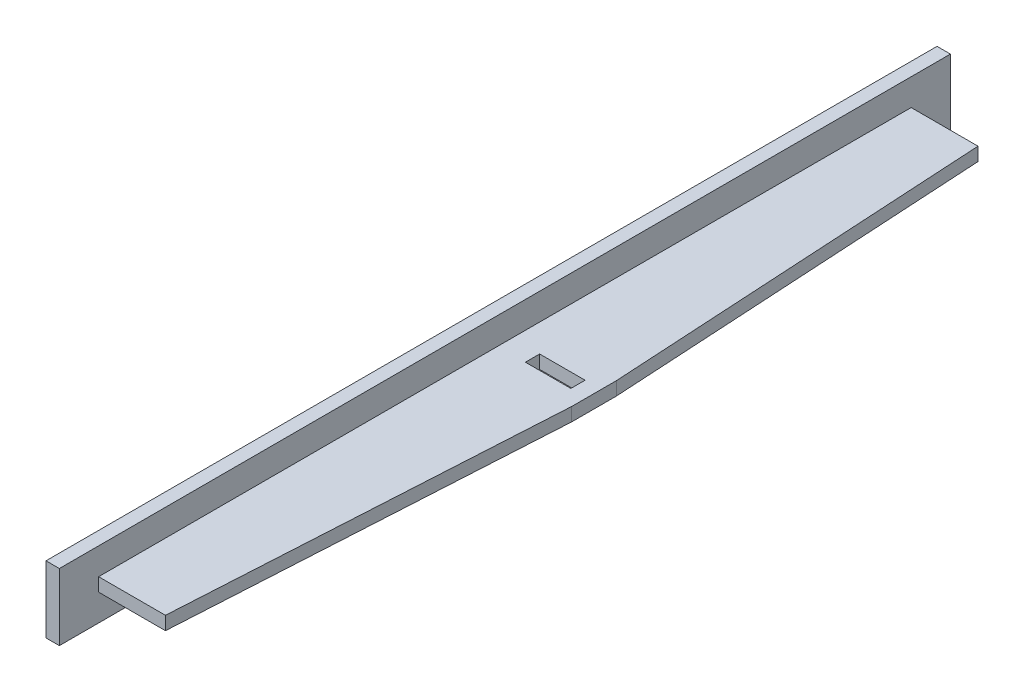
ISO-10303-21;
HEADER;
FILE_DESCRIPTION(('STEP AP214'),'2;1');
FILE_NAME('part.step','',(''),(''),'','','');
FILE_SCHEMA(('AUTOMOTIVE_DESIGN { 1 0 10303 214 1 1 1 1 }'));
ENDSEC;
DATA;
#1=APPLICATION_CONTEXT('core data for automotive mechanical design processes');
#2=APPLICATION_PROTOCOL_DEFINITION('international standard','automotive_design',2000,#1);
#3=PRODUCT_CONTEXT('',#1,'mechanical');
#4=PRODUCT('Part','Part','',(#3));
#5=PRODUCT_RELATED_PRODUCT_CATEGORY('part','',(#4));
#6=PRODUCT_DEFINITION_FORMATION('','',#4);
#7=PRODUCT_DEFINITION_CONTEXT('part definition',#1,'design');
#8=PRODUCT_DEFINITION('design','',#6,#7);
#9=PRODUCT_DEFINITION_SHAPE('','',#8);
#10=(LENGTH_UNIT() NAMED_UNIT(*) SI_UNIT(.MILLI.,.METRE.));
#11=(NAMED_UNIT(*) PLANE_ANGLE_UNIT() SI_UNIT($,.RADIAN.));
#12=(NAMED_UNIT(*) SI_UNIT($,.STERADIAN.) SOLID_ANGLE_UNIT());
#13=UNCERTAINTY_MEASURE_WITH_UNIT(LENGTH_MEASURE(1.E-05),#10,'distance_accuracy_value','');
#14=(GEOMETRIC_REPRESENTATION_CONTEXT(3) GLOBAL_UNCERTAINTY_ASSIGNED_CONTEXT((#13)) GLOBAL_UNIT_ASSIGNED_CONTEXT((#10,
#11,#12)) REPRESENTATION_CONTEXT('',''));
#15=CARTESIAN_POINT('',(0.,0.,0.));
#16=DIRECTION('',(0.,0.,1.));
#17=DIRECTION('',(1.,0.,0.));
#18=AXIS2_PLACEMENT_3D('',#15,#16,#17);
#19=CARTESIAN_POINT('',(3.,0.,200.));
#20=DIRECTION('',(-1.,0.,0.));
#21=DIRECTION('',(0.,0.,1.));
#22=AXIS2_PLACEMENT_3D('',#19,#20,#21);
#23=PLANE('',#22);
#24=DIRECTION('',(0.,1.,0.));
#25=VECTOR('',#24,1.);
#26=CARTESIAN_POINT('',(3.,0.,0.));
#27=LINE('',#26,#25);
#28=CARTESIAN_POINT('',(3.,0.,0.));
#29=VERTEX_POINT('',#28);
#30=CARTESIAN_POINT('',(3.,15.,0.));
#31=VERTEX_POINT('',#30);
#32=EDGE_CURVE('E235',#29,#31,#27,.T.);
#33=ORIENTED_EDGE('',*,*,#32,.T.);
#34=DIRECTION('',(0.,0.,-1.));
#35=VECTOR('',#34,1.);
#36=CARTESIAN_POINT('',(3.,15.,200.));
#37=LINE('',#36,#35);
#38=CARTESIAN_POINT('',(3.,15.,200.));
#39=VERTEX_POINT('',#38);
#40=EDGE_CURVE('E240',#39,#31,#37,.T.);
#41=ORIENTED_EDGE('',*,*,#40,.F.);
#42=DIRECTION('',(0.,1.,0.));
#43=VECTOR('',#42,1.);
#44=CARTESIAN_POINT('',(3.,0.,200.));
#45=LINE('',#44,#43);
#46=CARTESIAN_POINT('',(3.,0.,200.));
#47=VERTEX_POINT('',#46);
#48=EDGE_CURVE('E226',#47,#39,#45,.T.);
#49=ORIENTED_EDGE('',*,*,#48,.F.);
#50=DIRECTION('',(0.,0.,-1.));
#51=VECTOR('',#50,1.);
#52=CARTESIAN_POINT('',(3.,0.,200.));
#53=LINE('',#52,#51);
#54=EDGE_CURVE('E243',#47,#29,#53,.T.);
#55=ORIENTED_EDGE('',*,*,#54,.T.);
#56=EDGE_LOOP('',(#33,#41,#49,#55));
#57=FACE_BOUND('',#56,.T.);
#58=DIRECTION('',(0.,0.,1.));
#59=VECTOR('',#58,1.);
#60=CARTESIAN_POINT('',(3.,9.,8.80998377143878));
#61=LINE('',#60,#59);
#62=CARTESIAN_POINT('',(3.,9.,8.80998377143878));
#63=VERTEX_POINT('',#62);
#64=CARTESIAN_POINT('',(3.,9.,191.190016228561));
#65=VERTEX_POINT('',#64);
#66=EDGE_CURVE('E169',#63,#65,#61,.T.);
#67=ORIENTED_EDGE('',*,*,#66,.F.);
#68=DIRECTION('',(0.,1.,0.));
#69=VECTOR('',#68,1.);
#70=CARTESIAN_POINT('',(3.,6.,8.80998377143878));
#71=LINE('',#70,#69);
#72=CARTESIAN_POINT('',(3.,6.,8.80998377143878));
#73=VERTEX_POINT('',#72);
#74=EDGE_CURVE('E207',#73,#63,#71,.T.);
#75=ORIENTED_EDGE('',*,*,#74,.F.);
#76=DIRECTION('',(0.,0.,1.));
#77=VECTOR('',#76,1.);
#78=CARTESIAN_POINT('',(3.,6.,8.80998377143878));
#79=LINE('',#78,#77);
#80=CARTESIAN_POINT('',(3.,6.,191.190016228561));
#81=VERTEX_POINT('',#80);
#82=EDGE_CURVE('E172',#73,#81,#79,.T.);
#83=ORIENTED_EDGE('',*,*,#82,.T.);
#84=DIRECTION('',(0.,1.,0.));
#85=VECTOR('',#84,1.);
#86=CARTESIAN_POINT('',(3.,6.,191.190016228561));
#87=LINE('',#86,#85);
#88=EDGE_CURVE('E191',#81,#65,#87,.T.);
#89=ORIENTED_EDGE('',*,*,#88,.T.);
#90=EDGE_LOOP('',(#67,#75,#83,#89));
#91=FACE_BOUND('',#90,.T.);
#92=ADVANCED_FACE('F43',(#57,#91),#23,.F.);
#93=CARTESIAN_POINT('',(0.,0.,200.));
#94=DIRECTION('',(1.,0.,0.));
#95=DIRECTION('',(0.,0.,-1.));
#96=AXIS2_PLACEMENT_3D('',#93,#94,#95);
#97=PLANE('',#96);
#98=DIRECTION('',(0.,-1.,0.));
#99=VECTOR('',#98,1.);
#100=CARTESIAN_POINT('',(0.,0.,0.));
#101=LINE('',#100,#99);
#102=CARTESIAN_POINT('',(0.,15.,0.));
#103=VERTEX_POINT('',#102);
#104=CARTESIAN_POINT('',(0.,0.,0.));
#105=VERTEX_POINT('',#104);
#106=EDGE_CURVE('E209',#103,#105,#101,.T.);
#107=ORIENTED_EDGE('',*,*,#106,.T.);
#108=DIRECTION('',(0.,0.,-1.));
#109=VECTOR('',#108,1.);
#110=CARTESIAN_POINT('',(0.,0.,200.));
#111=LINE('',#110,#109);
#112=CARTESIAN_POINT('',(0.,0.,200.));
#113=VERTEX_POINT('',#112);
#114=EDGE_CURVE('E246',#113,#105,#111,.T.);
#115=ORIENTED_EDGE('',*,*,#114,.F.);
#116=DIRECTION('',(0.,-1.,0.));
#117=VECTOR('',#116,1.);
#118=CARTESIAN_POINT('',(0.,0.,200.));
#119=LINE('',#118,#117);
#120=CARTESIAN_POINT('',(0.,15.,200.));
#121=VERTEX_POINT('',#120);
#122=EDGE_CURVE('E220',#121,#113,#119,.T.);
#123=ORIENTED_EDGE('',*,*,#122,.F.);
#124=DIRECTION('',(0.,0.,-1.));
#125=VECTOR('',#124,1.);
#126=CARTESIAN_POINT('',(0.,15.,200.));
#127=LINE('',#126,#125);
#128=EDGE_CURVE('E230',#121,#103,#127,.T.);
#129=ORIENTED_EDGE('',*,*,#128,.T.);
#130=EDGE_LOOP('',(#107,#115,#123,#129));
#131=FACE_BOUND('',#130,.T.);
#132=ADVANCED_FACE('F45',(#131),#97,.F.);
#133=CARTESIAN_POINT('',(0.,0.,200.));
#134=DIRECTION('',(0.,1.,0.));
#135=DIRECTION('',(0.,0.,1.));
#136=AXIS2_PLACEMENT_3D('',#133,#134,#135);
#137=PLANE('',#136);
#138=DIRECTION('',(1.,0.,0.));
#139=VECTOR('',#138,1.);
#140=CARTESIAN_POINT('',(0.,0.,0.));
#141=LINE('',#140,#139);
#142=EDGE_CURVE('E233',#105,#29,#141,.T.);
#143=ORIENTED_EDGE('',*,*,#142,.T.);
#144=ORIENTED_EDGE('',*,*,#54,.F.);
#145=DIRECTION('',(1.,0.,0.));
#146=VECTOR('',#145,1.);
#147=CARTESIAN_POINT('',(0.,0.,200.));
#148=LINE('',#147,#146);
#149=EDGE_CURVE('E223',#113,#47,#148,.T.);
#150=ORIENTED_EDGE('',*,*,#149,.F.);
#151=ORIENTED_EDGE('',*,*,#114,.T.);
#152=EDGE_LOOP('',(#143,#144,#150,#151));
#153=FACE_BOUND('',#152,.T.);
#154=ADVANCED_FACE('F278',(#153),#137,.F.);
#155=CARTESIAN_POINT('',(0.,15.,200.));
#156=DIRECTION('',(0.,-1.,0.));
#157=DIRECTION('',(0.,0.,-1.));
#158=AXIS2_PLACEMENT_3D('',#155,#156,#157);
#159=PLANE('',#158);
#160=DIRECTION('',(-1.,0.,0.));
#161=VECTOR('',#160,1.);
#162=CARTESIAN_POINT('',(0.,15.,0.));
#163=LINE('',#162,#161);
#164=EDGE_CURVE('E224',#31,#103,#163,.T.);
#165=ORIENTED_EDGE('',*,*,#164,.T.);
#166=ORIENTED_EDGE('',*,*,#128,.F.);
#167=DIRECTION('',(-1.,0.,0.));
#168=VECTOR('',#167,1.);
#169=CARTESIAN_POINT('',(0.,15.,200.));
#170=LINE('',#169,#168);
#171=EDGE_CURVE('E228',#39,#121,#170,.T.);
#172=ORIENTED_EDGE('',*,*,#171,.F.);
#173=ORIENTED_EDGE('',*,*,#40,.T.);
#174=EDGE_LOOP('',(#165,#166,#172,#173));
#175=FACE_BOUND('',#174,.T.);
#176=ADVANCED_FACE('F282',(#175),#159,.F.);
#177=CARTESIAN_POINT('',(0.,0.,200.));
#178=DIRECTION('',(0.,0.,-1.));
#179=DIRECTION('',(-1.,0.,0.));
#180=AXIS2_PLACEMENT_3D('',#177,#178,#179);
#181=PLANE('',#180);
#182=ORIENTED_EDGE('',*,*,#122,.T.);
#183=ORIENTED_EDGE('',*,*,#149,.T.);
#184=ORIENTED_EDGE('',*,*,#48,.T.);
#185=ORIENTED_EDGE('',*,*,#171,.T.);
#186=EDGE_LOOP('',(#182,#183,#184,#185));
#187=FACE_BOUND('',#186,.T.);
#188=ADVANCED_FACE('F289',(#187),#181,.F.);
#189=CARTESIAN_POINT('',(0.,0.,0.));
#190=DIRECTION('',(0.,0.,-1.));
#191=DIRECTION('',(-1.,0.,0.));
#192=AXIS2_PLACEMENT_3D('',#189,#190,#191);
#193=PLANE('',#192);
#194=ORIENTED_EDGE('',*,*,#106,.F.);
#195=ORIENTED_EDGE('',*,*,#164,.F.);
#196=ORIENTED_EDGE('',*,*,#32,.F.);
#197=ORIENTED_EDGE('',*,*,#142,.F.);
#198=EDGE_LOOP('',(#194,#195,#196,#197));
#199=FACE_BOUND('',#198,.T.);
#200=ADVANCED_FACE('F299',(#199),#193,.T.);
#201=CARTESIAN_POINT('',(3.,6.,8.80998377143878));
#202=DIRECTION('',(0.,0.,-1.));
#203=DIRECTION('',(-1.,0.,0.));
#204=AXIS2_PLACEMENT_3D('',#201,#202,#203);
#205=PLANE('',#204);
#206=DIRECTION('',(-1.,0.,0.));
#207=VECTOR('',#206,1.);
#208=CARTESIAN_POINT('',(3.,9.,8.80998377143878));
#209=LINE('',#208,#207);
#210=CARTESIAN_POINT('',(18.,9.,8.80998377143878));
#211=VERTEX_POINT('',#210);
#212=EDGE_CURVE('E176',#211,#63,#209,.T.);
#213=ORIENTED_EDGE('',*,*,#212,.F.);
#214=DIRECTION('',(0.,1.,0.));
#215=VECTOR('',#214,1.);
#216=CARTESIAN_POINT('',(18.,6.,8.80998377143878));
#217=LINE('',#216,#215);
#218=CARTESIAN_POINT('',(18.,6.,8.80998377143878));
#219=VERTEX_POINT('',#218);
#220=EDGE_CURVE('E210',#219,#211,#217,.T.);
#221=ORIENTED_EDGE('',*,*,#220,.F.);
#222=DIRECTION('',(-1.,0.,0.));
#223=VECTOR('',#222,1.);
#224=CARTESIAN_POINT('',(3.,6.,8.80998377143878));
#225=LINE('',#224,#223);
#226=EDGE_CURVE('E188',#219,#73,#225,.T.);
#227=ORIENTED_EDGE('',*,*,#226,.T.);
#228=ORIENTED_EDGE('',*,*,#74,.T.);
#229=EDGE_LOOP('',(#213,#221,#227,#228));
#230=FACE_BOUND('',#229,.T.);
#231=ADVANCED_FACE('F308',(#230),#205,.T.);
#232=CARTESIAN_POINT('',(18.,6.,8.80998377143878));
#233=DIRECTION('',(0.998321576231747,0.,-0.0579139916614226));
#234=DIRECTION('',(-0.0579139916614226,0.,-0.998321576231747));
#235=AXIS2_PLACEMENT_3D('',#232,#233,#234);
#236=PLANE('',#235);
#237=DIRECTION('',(-0.0579139916614225,0.,-0.998321576231747));
#238=VECTOR('',#237,1.);
#239=CARTESIAN_POINT('',(18.,9.,8.80998377143878));
#240=LINE('',#239,#238);
#241=CARTESIAN_POINT('',(23.,9.,95.));
#242=VERTEX_POINT('',#241);
#243=EDGE_CURVE('E202',#242,#211,#240,.T.);
#244=ORIENTED_EDGE('',*,*,#243,.F.);
#245=DIRECTION('',(0.,1.,0.));
#246=VECTOR('',#245,1.);
#247=CARTESIAN_POINT('',(23.,6.,95.));
#248=LINE('',#247,#246);
#249=CARTESIAN_POINT('',(23.,6.,95.));
#250=VERTEX_POINT('',#249);
#251=EDGE_CURVE('E212',#250,#242,#248,.T.);
#252=ORIENTED_EDGE('',*,*,#251,.F.);
#253=DIRECTION('',(-0.0579139916614225,0.,-0.998321576231747));
#254=VECTOR('',#253,1.);
#255=CARTESIAN_POINT('',(18.,6.,8.80998377143878));
#256=LINE('',#255,#254);
#257=EDGE_CURVE('E185',#250,#219,#256,.T.);
#258=ORIENTED_EDGE('',*,*,#257,.T.);
#259=ORIENTED_EDGE('',*,*,#220,.T.);
#260=EDGE_LOOP('',(#244,#252,#258,#259));
#261=FACE_BOUND('',#260,.T.);
#262=ADVANCED_FACE('F321',(#261),#236,.T.);
#263=CARTESIAN_POINT('',(23.,6.,95.));
#264=DIRECTION('',(1.,0.,0.));
#265=DIRECTION('',(0.,0.,-1.));
#266=AXIS2_PLACEMENT_3D('',#263,#264,#265);
#267=PLANE('',#266);
#268=DIRECTION('',(0.,0.,-1.));
#269=VECTOR('',#268,1.);
#270=CARTESIAN_POINT('',(23.,9.,95.));
#271=LINE('',#270,#269);
#272=CARTESIAN_POINT('',(23.,9.,105.));
#273=VERTEX_POINT('',#272);
#274=EDGE_CURVE('E199',#273,#242,#271,.T.);
#275=ORIENTED_EDGE('',*,*,#274,.F.);
#276=DIRECTION('',(0.,1.,0.));
#277=VECTOR('',#276,1.);
#278=CARTESIAN_POINT('',(23.,6.,105.));
#279=LINE('',#278,#277);
#280=CARTESIAN_POINT('',(23.,6.,105.));
#281=VERTEX_POINT('',#280);
#282=EDGE_CURVE('E214',#281,#273,#279,.T.);
#283=ORIENTED_EDGE('',*,*,#282,.F.);
#284=DIRECTION('',(0.,0.,-1.));
#285=VECTOR('',#284,1.);
#286=CARTESIAN_POINT('',(23.,6.,95.));
#287=LINE('',#286,#285);
#288=EDGE_CURVE('E182',#281,#250,#287,.T.);
#289=ORIENTED_EDGE('',*,*,#288,.T.);
#290=ORIENTED_EDGE('',*,*,#251,.T.);
#291=EDGE_LOOP('',(#275,#283,#289,#290));
#292=FACE_BOUND('',#291,.T.);
#293=ADVANCED_FACE('F317',(#292),#267,.T.);
#294=CARTESIAN_POINT('',(18.,6.,191.190016228561));
#295=DIRECTION('',(0.998321576231747,0.,0.0579139916614226));
#296=DIRECTION('',(0.0579139916614226,0.,-0.998321576231747));
#297=AXIS2_PLACEMENT_3D('',#294,#295,#296);
#298=PLANE('',#297);
#299=DIRECTION('',(0.0579139916614226,0.,-0.998321576231747));
#300=VECTOR('',#299,1.);
#301=CARTESIAN_POINT('',(18.,9.,191.190016228561));
#302=LINE('',#301,#300);
#303=CARTESIAN_POINT('',(18.,9.,191.190016228561));
#304=VERTEX_POINT('',#303);
#305=EDGE_CURVE('E196',#304,#273,#302,.T.);
#306=ORIENTED_EDGE('',*,*,#305,.F.);
#307=DIRECTION('',(0.,1.,0.));
#308=VECTOR('',#307,1.);
#309=CARTESIAN_POINT('',(18.,6.,191.190016228561));
#310=LINE('',#309,#308);
#311=CARTESIAN_POINT('',(18.,6.,191.190016228561));
#312=VERTEX_POINT('',#311);
#313=EDGE_CURVE('E216',#312,#304,#310,.T.);
#314=ORIENTED_EDGE('',*,*,#313,.F.);
#315=DIRECTION('',(0.0579139916614226,0.,-0.998321576231747));
#316=VECTOR('',#315,1.);
#317=CARTESIAN_POINT('',(18.,6.,191.190016228561));
#318=LINE('',#317,#316);
#319=EDGE_CURVE('E179',#312,#281,#318,.T.);
#320=ORIENTED_EDGE('',*,*,#319,.T.);
#321=ORIENTED_EDGE('',*,*,#282,.T.);
#322=EDGE_LOOP('',(#306,#314,#320,#321));
#323=FACE_BOUND('',#322,.T.);
#324=ADVANCED_FACE('F313',(#323),#298,.T.);
#325=CARTESIAN_POINT('',(3.,6.,191.190016228561));
#326=DIRECTION('',(0.,0.,1.));
#327=DIRECTION('',(1.,0.,0.));
#328=AXIS2_PLACEMENT_3D('',#325,#326,#327);
#329=PLANE('',#328);
#330=DIRECTION('',(1.,0.,0.));
#331=VECTOR('',#330,1.);
#332=CARTESIAN_POINT('',(3.,9.,191.190016228561));
#333=LINE('',#332,#331);
#334=EDGE_CURVE('E193',#65,#304,#333,.T.);
#335=ORIENTED_EDGE('',*,*,#334,.F.);
#336=ORIENTED_EDGE('',*,*,#88,.F.);
#337=DIRECTION('',(1.,0.,0.));
#338=VECTOR('',#337,1.);
#339=CARTESIAN_POINT('',(3.,6.,191.190016228561));
#340=LINE('',#339,#338);
#341=EDGE_CURVE('E175',#81,#312,#340,.T.);
#342=ORIENTED_EDGE('',*,*,#341,.T.);
#343=ORIENTED_EDGE('',*,*,#313,.T.);
#344=EDGE_LOOP('',(#335,#336,#342,#343));
#345=FACE_BOUND('',#344,.T.);
#346=ADVANCED_FACE('F310',(#345),#329,.T.);
#347=CARTESIAN_POINT('',(0.,6.,0.));
#348=DIRECTION('',(0.,1.,0.));
#349=DIRECTION('',(0.,0.,1.));
#350=AXIS2_PLACEMENT_3D('',#347,#348,#349);
#351=PLANE('',#350);
#352=DIRECTION('',(-1.,0.,0.));
#353=VECTOR('',#352,1.);
#354=CARTESIAN_POINT('',(9.20000000000003,6.,101.6));
#355=LINE('',#354,#353);
#356=CARTESIAN_POINT('',(19.4,6.,101.6));
#357=VERTEX_POINT('',#356);
#358=CARTESIAN_POINT('',(9.20000000000003,6.,101.6));
#359=VERTEX_POINT('',#358);
#360=EDGE_CURVE('E155',#357,#359,#355,.T.);
#361=ORIENTED_EDGE('',*,*,#360,.F.);
#362=DIRECTION('',(0.,0.,1.));
#363=VECTOR('',#362,1.);
#364=CARTESIAN_POINT('',(19.4,6.,101.6));
#365=LINE('',#364,#363);
#366=CARTESIAN_POINT('',(19.4,6.,98.4));
#367=VERTEX_POINT('',#366);
#368=EDGE_CURVE('E58',#367,#357,#365,.T.);
#369=ORIENTED_EDGE('',*,*,#368,.F.);
#370=DIRECTION('',(1.,0.,0.));
#371=VECTOR('',#370,1.);
#372=CARTESIAN_POINT('',(9.20000000000003,6.,98.4));
#373=LINE('',#372,#371);
#374=CARTESIAN_POINT('',(9.20000000000003,6.,98.4));
#375=VERTEX_POINT('',#374);
#376=EDGE_CURVE('E162',#375,#367,#373,.T.);
#377=ORIENTED_EDGE('',*,*,#376,.F.);
#378=DIRECTION('',(0.,0.,-1.));
#379=VECTOR('',#378,1.);
#380=CARTESIAN_POINT('',(9.20000000000003,6.,101.6));
#381=LINE('',#380,#379);
#382=EDGE_CURVE('E146',#359,#375,#381,.T.);
#383=ORIENTED_EDGE('',*,*,#382,.F.);
#384=EDGE_LOOP('',(#361,#369,#377,#383));
#385=FACE_BOUND('',#384,.T.);
#386=ORIENTED_EDGE('',*,*,#82,.F.);
#387=ORIENTED_EDGE('',*,*,#226,.F.);
#388=ORIENTED_EDGE('',*,*,#257,.F.);
#389=ORIENTED_EDGE('',*,*,#288,.F.);
#390=ORIENTED_EDGE('',*,*,#319,.F.);
#391=ORIENTED_EDGE('',*,*,#341,.F.);
#392=EDGE_LOOP('',(#386,#387,#388,#389,#390,#391));
#393=FACE_BOUND('',#392,.T.);
#394=ADVANCED_FACE('F159',(#385,#393),#351,.F.);
#395=CARTESIAN_POINT('',(0.,9.,0.));
#396=DIRECTION('',(0.,1.,0.));
#397=DIRECTION('',(0.,0.,1.));
#398=AXIS2_PLACEMENT_3D('',#395,#396,#397);
#399=PLANE('',#398);
#400=DIRECTION('',(0.,0.,-1.));
#401=VECTOR('',#400,1.);
#402=CARTESIAN_POINT('',(19.4,9.,0.));
#403=LINE('',#402,#401);
#404=CARTESIAN_POINT('',(19.4,9.,101.6));
#405=VERTEX_POINT('',#404);
#406=CARTESIAN_POINT('',(19.4,9.,98.4));
#407=VERTEX_POINT('',#406);
#408=EDGE_CURVE('E11',#405,#407,#403,.T.);
#409=ORIENTED_EDGE('',*,*,#408,.F.);
#410=DIRECTION('',(1.,0.,0.));
#411=VECTOR('',#410,1.);
#412=CARTESIAN_POINT('',(0.,9.,101.6));
#413=LINE('',#412,#411);
#414=CARTESIAN_POINT('',(9.20000000000003,9.,101.6));
#415=VERTEX_POINT('',#414);
#416=EDGE_CURVE('E249',#415,#405,#413,.T.);
#417=ORIENTED_EDGE('',*,*,#416,.F.);
#418=DIRECTION('',(0.,0.,1.));
#419=VECTOR('',#418,1.);
#420=CARTESIAN_POINT('',(9.20000000000003,9.,0.));
#421=LINE('',#420,#419);
#422=CARTESIAN_POINT('',(9.20000000000003,9.,98.4));
#423=VERTEX_POINT('',#422);
#424=EDGE_CURVE('E149',#423,#415,#421,.T.);
#425=ORIENTED_EDGE('',*,*,#424,.F.);
#426=DIRECTION('',(-1.,0.,0.));
#427=VECTOR('',#426,1.);
#428=CARTESIAN_POINT('',(0.,9.,98.4));
#429=LINE('',#428,#427);
#430=EDGE_CURVE('E51',#407,#423,#429,.T.);
#431=ORIENTED_EDGE('',*,*,#430,.F.);
#432=EDGE_LOOP('',(#409,#417,#425,#431));
#433=FACE_BOUND('',#432,.T.);
#434=ORIENTED_EDGE('',*,*,#66,.T.);
#435=ORIENTED_EDGE('',*,*,#334,.T.);
#436=ORIENTED_EDGE('',*,*,#305,.T.);
#437=ORIENTED_EDGE('',*,*,#274,.T.);
#438=ORIENTED_EDGE('',*,*,#243,.T.);
#439=ORIENTED_EDGE('',*,*,#212,.T.);
#440=EDGE_LOOP('',(#434,#435,#436,#437,#438,#439));
#441=FACE_BOUND('',#440,.T.);
#442=ADVANCED_FACE('F257',(#433,#441),#399,.T.);
#443=CARTESIAN_POINT('',(19.4,29.,101.6));
#444=DIRECTION('',(1.,0.,0.));
#445=DIRECTION('',(0.,0.,-1.));
#446=AXIS2_PLACEMENT_3D('',#443,#444,#445);
#447=PLANE('',#446);
#448=ORIENTED_EDGE('',*,*,#408,.T.);
#449=DIRECTION('',(0.,-1.,0.));
#450=VECTOR('',#449,1.);
#451=CARTESIAN_POINT('',(19.4,29.,98.4));
#452=LINE('',#451,#450);
#453=EDGE_CURVE('E167',#407,#367,#452,.T.);
#454=ORIENTED_EDGE('',*,*,#453,.T.);
#455=ORIENTED_EDGE('',*,*,#368,.T.);
#456=DIRECTION('',(0.,-1.,0.));
#457=VECTOR('',#456,1.);
#458=CARTESIAN_POINT('',(19.4,29.,101.6));
#459=LINE('',#458,#457);
#460=EDGE_CURVE('E152',#405,#357,#459,.T.);
#461=ORIENTED_EDGE('',*,*,#460,.F.);
#462=EDGE_LOOP('',(#448,#454,#455,#461));
#463=FACE_BOUND('',#462,.T.);
#464=ADVANCED_FACE('F259',(#463),#447,.F.);
#465=CARTESIAN_POINT('',(9.20000000000003,29.,98.4));
#466=DIRECTION('',(0.,0.,-1.));
#467=DIRECTION('',(-1.,0.,0.));
#468=AXIS2_PLACEMENT_3D('',#465,#466,#467);
#469=PLANE('',#468);
#470=ORIENTED_EDGE('',*,*,#430,.T.);
#471=DIRECTION('',(0.,-1.,0.));
#472=VECTOR('',#471,1.);
#473=CARTESIAN_POINT('',(9.20000000000003,29.,98.4));
#474=LINE('',#473,#472);
#475=EDGE_CURVE('E151',#423,#375,#474,.T.);
#476=ORIENTED_EDGE('',*,*,#475,.T.);
#477=ORIENTED_EDGE('',*,*,#376,.T.);
#478=ORIENTED_EDGE('',*,*,#453,.F.);
#479=EDGE_LOOP('',(#470,#476,#477,#478));
#480=FACE_BOUND('',#479,.T.);
#481=ADVANCED_FACE('F254',(#480),#469,.F.);
#482=CARTESIAN_POINT('',(9.20000000000003,29.,101.6));
#483=DIRECTION('',(-1.,0.,0.));
#484=DIRECTION('',(0.,0.,1.));
#485=AXIS2_PLACEMENT_3D('',#482,#483,#484);
#486=PLANE('',#485);
#487=ORIENTED_EDGE('',*,*,#424,.T.);
#488=DIRECTION('',(0.,-1.,0.));
#489=VECTOR('',#488,1.);
#490=CARTESIAN_POINT('',(9.20000000000003,29.,101.6));
#491=LINE('',#490,#489);
#492=EDGE_CURVE('E66',#415,#359,#491,.T.);
#493=ORIENTED_EDGE('',*,*,#492,.T.);
#494=ORIENTED_EDGE('',*,*,#382,.T.);
#495=ORIENTED_EDGE('',*,*,#475,.F.);
#496=EDGE_LOOP('',(#487,#493,#494,#495));
#497=FACE_BOUND('',#496,.T.);
#498=ADVANCED_FACE('F143',(#497),#486,.F.);
#499=CARTESIAN_POINT('',(9.20000000000003,29.,101.6));
#500=DIRECTION('',(0.,0.,1.));
#501=DIRECTION('',(1.,0.,0.));
#502=AXIS2_PLACEMENT_3D('',#499,#500,#501);
#503=PLANE('',#502);
#504=ORIENTED_EDGE('',*,*,#416,.T.);
#505=ORIENTED_EDGE('',*,*,#460,.T.);
#506=ORIENTED_EDGE('',*,*,#360,.T.);
#507=ORIENTED_EDGE('',*,*,#492,.F.);
#508=EDGE_LOOP('',(#504,#505,#506,#507));
#509=FACE_BOUND('',#508,.T.);
#510=ADVANCED_FACE('F156',(#509),#503,.F.);
#511=CLOSED_SHELL('',(#92,#132,#154,#176,#188,#200,#231,#262,#293,#324,#346,#394,#442,#464,#481,
#498,#510));
#512=MANIFOLD_SOLID_BREP('B2',#511);
#513=ADVANCED_BREP_SHAPE_REPRESENTATION('',(#18,#512),#14);
#514=SHAPE_DEFINITION_REPRESENTATION(#9,#513);
ENDSEC;
END-ISO-10303-21;
